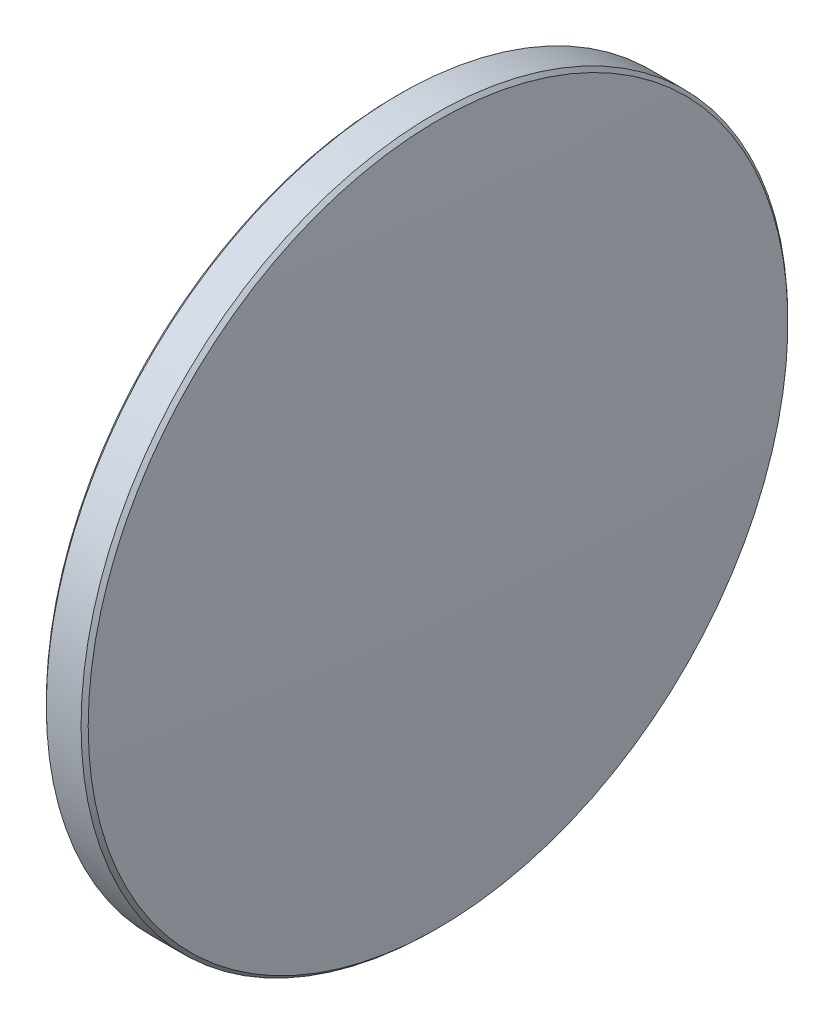
ISO-10303-21;
HEADER;
FILE_DESCRIPTION(('STEP AP214'),'2;1');
FILE_NAME('part.step','',(''),(''),'','','');
FILE_SCHEMA(('AUTOMOTIVE_DESIGN { 1 0 10303 214 1 1 1 1 }'));
ENDSEC;
DATA;
#1=APPLICATION_CONTEXT('core data for automotive mechanical design processes');
#2=APPLICATION_PROTOCOL_DEFINITION('international standard','automotive_design',2000,#1);
#3=PRODUCT_CONTEXT('',#1,'mechanical');
#4=PRODUCT('Part','Part','',(#3));
#5=PRODUCT_RELATED_PRODUCT_CATEGORY('part','',(#4));
#6=PRODUCT_DEFINITION_FORMATION('','',#4);
#7=PRODUCT_DEFINITION_CONTEXT('part definition',#1,'design');
#8=PRODUCT_DEFINITION('design','',#6,#7);
#9=PRODUCT_DEFINITION_SHAPE('','',#8);
#10=(LENGTH_UNIT() NAMED_UNIT(*) SI_UNIT(.MILLI.,.METRE.));
#11=(NAMED_UNIT(*) PLANE_ANGLE_UNIT() SI_UNIT($,.RADIAN.));
#12=(NAMED_UNIT(*) SI_UNIT($,.STERADIAN.) SOLID_ANGLE_UNIT());
#13=UNCERTAINTY_MEASURE_WITH_UNIT(LENGTH_MEASURE(1.E-05),#10,'distance_accuracy_value','');
#14=(GEOMETRIC_REPRESENTATION_CONTEXT(3) GLOBAL_UNCERTAINTY_ASSIGNED_CONTEXT((#13)) GLOBAL_UNIT_ASSIGNED_CONTEXT((#10,
#11,#12)) REPRESENTATION_CONTEXT('',''));
#15=CARTESIAN_POINT('',(0.,0.,0.));
#16=DIRECTION('',(0.,0.,1.));
#17=DIRECTION('',(1.,0.,0.));
#18=AXIS2_PLACEMENT_3D('',#15,#16,#17);
#19=CARTESIAN_POINT('',(-1.85,0.,0.));
#20=DIRECTION('',(1.,0.,0.));
#21=DIRECTION('',(0.,0.,-1.));
#22=AXIS2_PLACEMENT_3D('',#19,#20,#21);
#23=PLANE('',#22);
#24=CARTESIAN_POINT('',(-1.85,0.,0.));
#25=DIRECTION('',(1.,0.,0.));
#26=DIRECTION('',(0.,0.,-1.));
#27=AXIS2_PLACEMENT_3D('',#24,#25,#26);
#28=CIRCLE('',#27,25.15);
#29=CARTESIAN_POINT('',(-1.85,0.,-25.15));
#30=VERTEX_POINT('',#29);
#31=EDGE_CURVE('E10',#30,#30,#28,.F.);
#32=ORIENTED_EDGE('',*,*,#31,.T.);
#33=EDGE_LOOP('',(#32));
#34=FACE_BOUND('',#33,.T.);
#35=ADVANCED_FACE('F15',(#34),#23,.F.);
#36=CARTESIAN_POINT('',(-1.85,0.,0.));
#37=DIRECTION('',(-1.,0.,0.));
#38=DIRECTION('',(0.,0.,1.));
#39=AXIS2_PLACEMENT_3D('',#36,#37,#38);
#40=CYLINDRICAL_SURFACE('',#39,25.4);
#41=CARTESIAN_POINT('',(0.900000000000123,0.,0.));
#42=DIRECTION('',(-1.,0.,0.));
#43=DIRECTION('',(0.,0.,1.));
#44=AXIS2_PLACEMENT_3D('',#41,#42,#43);
#45=CIRCLE('',#44,25.4);
#46=CARTESIAN_POINT('',(0.900000000000123,0.,25.4));
#47=VERTEX_POINT('',#46);
#48=EDGE_CURVE('E55',#47,#47,#45,.T.);
#49=ORIENTED_EDGE('',*,*,#48,.T.);
#50=EDGE_LOOP('',(#49));
#51=FACE_BOUND('',#50,.T.);
#52=CARTESIAN_POINT('',(-1.59999999999999,0.,0.));
#53=DIRECTION('',(1.,0.,0.));
#54=DIRECTION('',(0.,0.,-1.));
#55=AXIS2_PLACEMENT_3D('',#52,#53,#54);
#56=CIRCLE('',#55,25.4);
#57=CARTESIAN_POINT('',(-1.59999999999999,0.,-25.4));
#58=VERTEX_POINT('',#57);
#59=EDGE_CURVE('E53',#58,#58,#56,.T.);
#60=ORIENTED_EDGE('',*,*,#59,.T.);
#61=EDGE_LOOP('',(#60));
#62=FACE_BOUND('',#61,.T.);
#63=ADVANCED_FACE('F28',(#51,#62),#40,.T.);
#64=CARTESIAN_POINT('',(-458.249999039837,0.,0.0297244359100043));
#65=DIRECTION('',(0.,-1.,0.));
#66=DIRECTION('',(0.,0.,1.));
#67=AXIS2_PLACEMENT_3D('',#64,#65,#66);
#68=CIRCLE('',#67,460.1);
#69=TRIMMED_CURVE('',#68,(PARAMETER_VALUE(-1.57086093108946)),
(PARAMETER_VALUE(1.57086093108946)),.T.,.PARAMETER.);
#70=CARTESIAN_POINT('',(-458.249999039837,0.,0.));
#71=DIRECTION('',(-1.,0.,0.));
#72=AXIS1_PLACEMENT('',#70,#71);
#73=SURFACE_OF_REVOLUTION('',#69,#72);
#74=CARTESIAN_POINT('',(1.16371346325844,0.,0.));
#75=DIRECTION('',(-1.,0.,0.));
#76=DIRECTION('',(0.,0.,1.));
#77=AXIS2_PLACEMENT_3D('',#74,#75,#76);
#78=CIRCLE('',#77,25.1504482336701);
#79=CARTESIAN_POINT('',(1.16371346325844,0.,25.1504482336701));
#80=VERTEX_POINT('',#79);
#81=EDGE_CURVE('E22',#80,#80,#78,.F.);
#82=ORIENTED_EDGE('',*,*,#81,.T.);
#83=EDGE_LOOP('',(#82));
#84=FACE_BOUND('',#83,.T.);
#85=CARTESIAN_POINT('',(1.85,0.,0.));
#86=VERTEX_POINT('',#85);
#87=VERTEX_LOOP('',#86);
#88=FACE_BOUND('',#87,.T.);
#89=ADVANCED_FACE('F25',(#84,#88),#73,.T.);
#90=CARTESIAN_POINT('',(0.900000000000123,0.,0.));
#91=DIRECTION('',(-1.,0.,0.));
#92=DIRECTION('',(0.,0.,1.));
#93=AXIS2_PLACEMENT_3D('',#90,#91,#92);
#94=CONICAL_SURFACE('',#93,25.4,0.757813780002535);
#95=ORIENTED_EDGE('',*,*,#81,.F.);
#96=EDGE_LOOP('',(#95));
#97=FACE_BOUND('',#96,.T.);
#98=ORIENTED_EDGE('',*,*,#48,.F.);
#99=EDGE_LOOP('',(#98));
#100=FACE_BOUND('',#99,.T.);
#101=ADVANCED_FACE('F27',(#97,#100),#94,.T.);
#102=CARTESIAN_POINT('',(-1.85,0.,0.));
#103=DIRECTION('',(1.,0.,0.));
#104=DIRECTION('',(0.,0.,-1.));
#105=AXIS2_PLACEMENT_3D('',#102,#103,#104);
#106=CONICAL_SURFACE('',#105,25.15,0.785398163397469);
#107=ORIENTED_EDGE('',*,*,#59,.F.);
#108=EDGE_LOOP('',(#107));
#109=FACE_BOUND('',#108,.T.);
#110=ORIENTED_EDGE('',*,*,#31,.F.);
#111=EDGE_LOOP('',(#110));
#112=FACE_BOUND('',#111,.T.);
#113=ADVANCED_FACE('F17',(#109,#112),#106,.T.);
#114=CLOSED_SHELL('',(#35,#63,#89,#101,#113));
#115=MANIFOLD_SOLID_BREP('B1',#114);
#116=ADVANCED_BREP_SHAPE_REPRESENTATION('',(#18,#115),#14);
#117=SHAPE_DEFINITION_REPRESENTATION(#9,#116);
ENDSEC;
END-ISO-10303-21;
